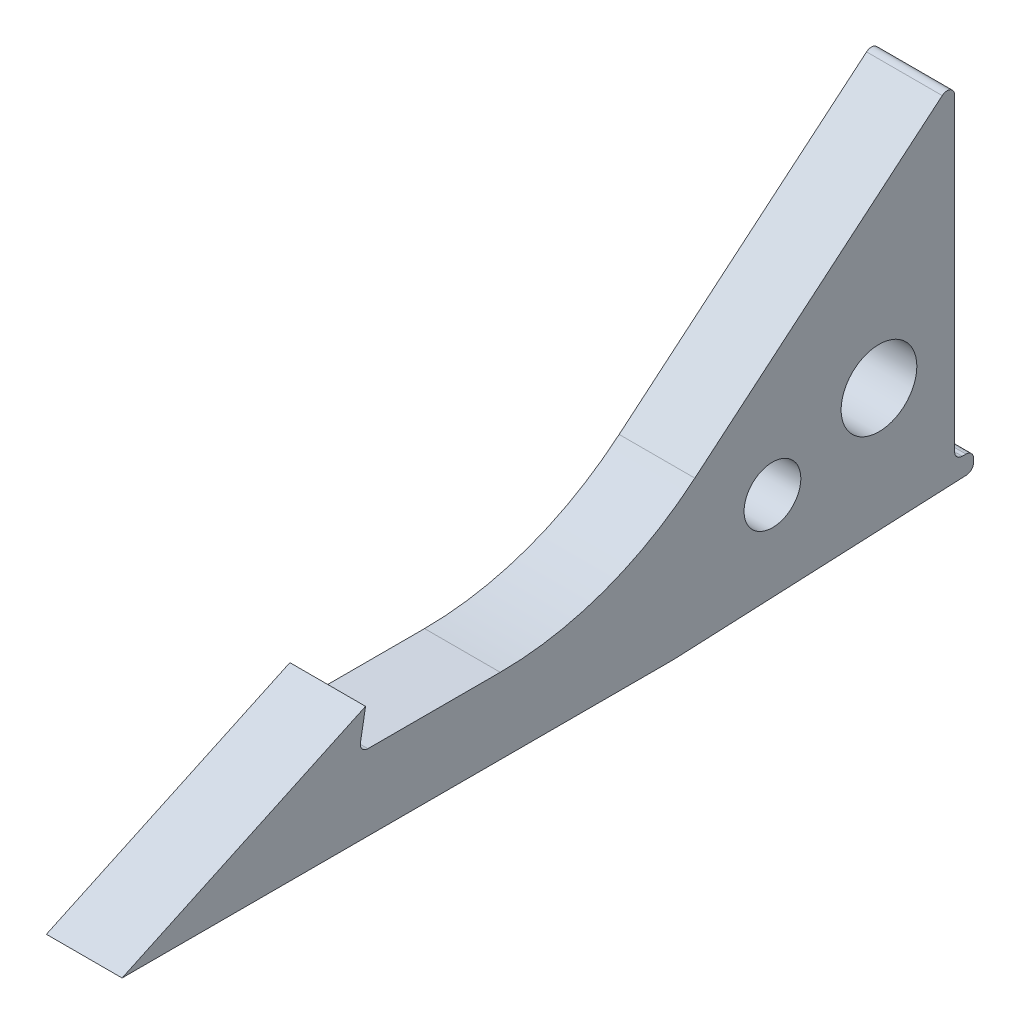
ISO-10303-21;
HEADER;
FILE_DESCRIPTION(('STEP AP214'),'2;1');
FILE_NAME('part.step','',(''),(''),'','','');
FILE_SCHEMA(('AUTOMOTIVE_DESIGN { 1 0 10303 214 1 1 1 1 }'));
ENDSEC;
DATA;
#1=APPLICATION_CONTEXT('core data for automotive mechanical design processes');
#2=APPLICATION_PROTOCOL_DEFINITION('international standard','automotive_design',2000,#1);
#3=PRODUCT_CONTEXT('',#1,'mechanical');
#4=PRODUCT('Part','Part','',(#3));
#5=PRODUCT_RELATED_PRODUCT_CATEGORY('part','',(#4));
#6=PRODUCT_DEFINITION_FORMATION('','',#4);
#7=PRODUCT_DEFINITION_CONTEXT('part definition',#1,'design');
#8=PRODUCT_DEFINITION('design','',#6,#7);
#9=PRODUCT_DEFINITION_SHAPE('','',#8);
#10=(LENGTH_UNIT() NAMED_UNIT(*) SI_UNIT(.MILLI.,.METRE.));
#11=(NAMED_UNIT(*) PLANE_ANGLE_UNIT() SI_UNIT($,.RADIAN.));
#12=(NAMED_UNIT(*) SI_UNIT($,.STERADIAN.) SOLID_ANGLE_UNIT());
#13=UNCERTAINTY_MEASURE_WITH_UNIT(LENGTH_MEASURE(1.E-05),#10,'distance_accuracy_value','');
#14=(GEOMETRIC_REPRESENTATION_CONTEXT(3) GLOBAL_UNCERTAINTY_ASSIGNED_CONTEXT((#13)) GLOBAL_UNIT_ASSIGNED_CONTEXT((#10,
#11,#12)) REPRESENTATION_CONTEXT('',''));
#15=CARTESIAN_POINT('',(0.,0.,0.));
#16=DIRECTION('',(0.,0.,1.));
#17=DIRECTION('',(1.,0.,0.));
#18=AXIS2_PLACEMENT_3D('',#15,#16,#17);
#19=CARTESIAN_POINT('',(15.875,0.,0.));
#20=DIRECTION('',(1.,0.,0.));
#21=DIRECTION('',(0.,0.,-1.));
#22=AXIS2_PLACEMENT_3D('',#19,#20,#21);
#23=PLANE('',#22);
#24=CARTESIAN_POINT('',(15.875,11.1125,46.27372));
#25=DIRECTION('',(1.,0.,0.));
#26=DIRECTION('',(0.,0.,-1.));
#27=AXIS2_PLACEMENT_3D('',#24,#25,#26);
#28=CIRCLE('',#27,3.175);
#29=CARTESIAN_POINT('',(15.875,11.1125,43.09872));
#30=VERTEX_POINT('',#29);
#31=EDGE_CURVE('E181',#30,#30,#28,.T.);
#32=ORIENTED_EDGE('',*,*,#31,.F.);
#33=EDGE_LOOP('',(#32));
#34=FACE_BOUND('',#33,.T.);
#35=DIRECTION('',(0.,0.,-1.));
#36=VECTOR('',#35,1.);
#37=CARTESIAN_POINT('',(15.875,0.,109.77372));
#38=LINE('',#37,#36);
#39=CARTESIAN_POINT('',(15.875,0.,109.77372));
#40=VERTEX_POINT('',#39);
#41=CARTESIAN_POINT('',(15.875,0.,64.0765676031377));
#42=VERTEX_POINT('',#41);
#43=EDGE_CURVE('E173',#40,#42,#38,.T.);
#44=ORIENTED_EDGE('',*,*,#43,.T.);
#45=CARTESIAN_POINT('',(15.875,25.4,64.0765676031377));
#46=DIRECTION('',(1.,0.,0.));
#47=DIRECTION('',(0.,0.,-1.));
#48=AXIS2_PLACEMENT_3D('',#45,#46,#47);
#49=CIRCLE('',#48,25.4);
#50=CARTESIAN_POINT('',(15.875,0.0261621258748286,62.9240262643513));
#51=VERTEX_POINT('',#50);
#52=EDGE_CURVE('E255',#42,#51,#49,.T.);
#53=ORIENTED_EDGE('',*,*,#52,.T.);
#54=DIRECTION('',(0.,0.0453756432593051,-0.998969995044298));
#55=VECTOR('',#54,1.);
#56=CARTESIAN_POINT('',(15.875,0.,63.5000000000002));
#57=LINE('',#56,#55);
#58=CARTESIAN_POINT('',(15.875,1.11546553851433,38.9424064665303));
#59=VERTEX_POINT('',#58);
#60=EDGE_CURVE('E200',#51,#59,#57,.T.);
#61=ORIENTED_EDGE('',*,*,#60,.T.);
#62=CARTESIAN_POINT('',(15.875,1.74981148536745,38.97122));
#63=DIRECTION('',(1.,0.,0.));
#64=DIRECTION('',(0.,0.,-1.));
#65=AXIS2_PLACEMENT_3D('',#62,#63,#64);
#66=CIRCLE('',#65,0.635);
#67=CARTESIAN_POINT('',(15.875,1.74981148536745,38.33622));
#68=VERTEX_POINT('',#67);
#69=EDGE_CURVE('E220',#59,#68,#66,.T.);
#70=ORIENTED_EDGE('',*,*,#69,.T.);
#71=DIRECTION('',(0.,1.,0.));
#72=VECTOR('',#71,1.);
#73=CARTESIAN_POINT('',(15.875,1.14300000000001,38.33622));
#74=LINE('',#73,#72);
#75=CARTESIAN_POINT('',(15.875,2.03200000000001,38.33622));
#76=VERTEX_POINT('',#75);
#77=EDGE_CURVE('E282',#68,#76,#74,.T.);
#78=ORIENTED_EDGE('',*,*,#77,.T.);
#79=CARTESIAN_POINT('',(15.875,2.03200000000001,38.97122));
#80=DIRECTION('',(1.,0.,0.));
#81=DIRECTION('',(0.,0.,-1.));
#82=AXIS2_PLACEMENT_3D('',#79,#80,#81);
#83=CIRCLE('',#82,0.635);
#84=CARTESIAN_POINT('',(15.875,2.66700000000001,38.97122));
#85=VERTEX_POINT('',#84);
#86=EDGE_CURVE('E218',#76,#85,#83,.T.);
#87=ORIENTED_EDGE('',*,*,#86,.T.);
#88=DIRECTION('',(0.,0.,1.));
#89=VECTOR('',#88,1.);
#90=CARTESIAN_POINT('',(15.875,2.66700000000001,38.33622));
#91=LINE('',#90,#89);
#92=CARTESIAN_POINT('',(15.875,2.66700000000001,39.28872));
#93=VERTEX_POINT('',#92);
#94=EDGE_CURVE('E279',#85,#93,#91,.T.);
#95=ORIENTED_EDGE('',*,*,#94,.T.);
#96=CARTESIAN_POINT('',(15.875,3.30200000000001,39.28872));
#97=DIRECTION('',(1.,0.,0.));
#98=DIRECTION('',(0.,0.,-1.));
#99=AXIS2_PLACEMENT_3D('',#96,#97,#98);
#100=CIRCLE('',#99,0.635);
#101=CARTESIAN_POINT('',(15.875,3.30200000000001,39.92372));
#102=VERTEX_POINT('',#101);
#103=EDGE_CURVE('E246',#93,#102,#100,.F.);
#104=ORIENTED_EDGE('',*,*,#103,.T.);
#105=DIRECTION('',(0.,1.,0.));
#106=VECTOR('',#105,1.);
#107=CARTESIAN_POINT('',(15.875,2.66700000000001,39.92372));
#108=LINE('',#107,#106);
#109=CARTESIAN_POINT('',(15.875,29.2220821357437,39.92372));
#110=VERTEX_POINT('',#109);
#111=EDGE_CURVE('E274',#102,#110,#108,.T.);
#112=ORIENTED_EDGE('',*,*,#111,.T.);
#113=CARTESIAN_POINT('',(15.875,29.2220821357437,40.55872));
#114=DIRECTION('',(1.,0.,0.));
#115=DIRECTION('',(0.,0.,-1.));
#116=AXIS2_PLACEMENT_3D('',#113,#114,#115);
#117=CIRCLE('',#116,0.635);
#118=CARTESIAN_POINT('',(15.875,29.7085203571243,40.9668901321509));
#119=VERTEX_POINT('',#118);
#120=EDGE_CURVE('E216',#110,#119,#117,.T.);
#121=ORIENTED_EDGE('',*,*,#120,.T.);
#122=DIRECTION('',(0.,-0.642787609686539,0.766044443118978));
#123=VECTOR('',#122,1.);
#124=CARTESIAN_POINT('',(15.875,30.5838440302673,39.92372));
#125=LINE('',#124,#123);
#126=CARTESIAN_POINT('',(15.875,12.2924711447779,61.7225293497622));
#127=VERTEX_POINT('',#126);
#128=EDGE_CURVE('E273',#119,#127,#125,.T.);
#129=ORIENTED_EDGE('',*,*,#128,.T.);
#130=CARTESIAN_POINT('',(15.875,31.75,78.0493346358003));
#131=DIRECTION('',(1.,0.,0.));
#132=DIRECTION('',(0.,0.,-1.));
#133=AXIS2_PLACEMENT_3D('',#130,#131,#132);
#134=CIRCLE('',#133,25.4);
#135=CARTESIAN_POINT('',(15.875,6.34999999999998,78.0493346358003));
#136=VERTEX_POINT('',#135);
#137=EDGE_CURVE('E11',#127,#136,#134,.F.);
#138=ORIENTED_EDGE('',*,*,#137,.T.);
#139=DIRECTION('',(0.,0.,1.));
#140=VECTOR('',#139,1.);
#141=CARTESIAN_POINT('',(15.875,6.34999999999998,68.8044906854388));
#142=LINE('',#141,#140);
#143=CARTESIAN_POINT('',(15.875,6.34999999999998,89.1503662145982));
#144=VERTEX_POINT('',#143);
#145=EDGE_CURVE('E158',#136,#144,#142,.T.);
#146=ORIENTED_EDGE('',*,*,#145,.T.);
#147=CARTESIAN_POINT('',(15.875,6.98499999999998,89.1503662145982));
#148=DIRECTION('',(1.,0.,0.));
#149=DIRECTION('',(0.,0.,-1.));
#150=AXIS2_PLACEMENT_3D('',#147,#148,#149);
#151=CIRCLE('',#150,0.635);
#152=CARTESIAN_POINT('',(15.875,7.09526659281849,89.7757191377609));
#153=VERTEX_POINT('',#152);
#154=EDGE_CURVE('E154',#144,#153,#151,.F.);
#155=ORIENTED_EDGE('',*,*,#154,.T.);
#156=DIRECTION('',(0.,0.984807753012207,-0.173648177666936));
#157=VECTOR('',#156,1.);
#158=CARTESIAN_POINT('',(15.875,6.34999999999998,89.9071297458955));
#159=LINE('',#158,#157);
#160=CARTESIAN_POINT('',(15.875,9.52499999999999,89.3472915821461));
#161=VERTEX_POINT('',#160);
#162=EDGE_CURVE('E146',#153,#161,#159,.T.);
#163=ORIENTED_EDGE('',*,*,#162,.T.);
#164=DIRECTION('',(0.,-0.422618261740694,0.906307787036653));
#165=VECTOR('',#164,1.);
#166=CARTESIAN_POINT('',(15.875,9.52499999999999,89.3472915821461));
#167=LINE('',#166,#165);
#168=EDGE_CURVE('E151',#161,#40,#167,.T.);
#169=ORIENTED_EDGE('',*,*,#168,.T.);
#170=EDGE_LOOP('',(#44,#53,#61,#70,#78,#87,#95,#104,#112,#121,#129,#138,#146,#155,#163,#169));
#171=FACE_BOUND('',#170,.T.);
#172=CARTESIAN_POINT('',(15.875,7.81806875397115,55.2108530842272));
#173=DIRECTION('',(1.,0.,0.));
#174=DIRECTION('',(0.,0.,-1.));
#175=AXIS2_PLACEMENT_3D('',#172,#173,#174);
#176=CIRCLE('',#175,2.38125);
#177=CARTESIAN_POINT('',(15.875,7.81806875397115,52.8296030842272));
#178=VERTEX_POINT('',#177);
#179=EDGE_CURVE('E289',#178,#178,#176,.T.);
#180=ORIENTED_EDGE('',*,*,#179,.F.);
#181=EDGE_LOOP('',(#180));
#182=FACE_BOUND('',#181,.T.);
#183=ADVANCED_FACE('F35',(#34,#171,#182),#23,.T.);
#184=CARTESIAN_POINT('',(9.52499999999998,0.,0.));
#185=DIRECTION('',(1.,0.,0.));
#186=DIRECTION('',(0.,0.,-1.));
#187=AXIS2_PLACEMENT_3D('',#184,#185,#186);
#188=PLANE('',#187);
#189=DIRECTION('',(0.,0.0453756432593051,-0.998969995044298));
#190=VECTOR('',#189,1.);
#191=CARTESIAN_POINT('',(9.52499999999998,0.,63.5000000000002));
#192=LINE('',#191,#190);
#193=CARTESIAN_POINT('',(9.52499999999998,0.0261621258748286,62.9240262643513));
#194=VERTEX_POINT('',#193);
#195=CARTESIAN_POINT('',(9.52499999999998,1.11546553851433,38.9424064665303));
#196=VERTEX_POINT('',#195);
#197=EDGE_CURVE('E178',#194,#196,#192,.T.);
#198=ORIENTED_EDGE('',*,*,#197,.F.);
#199=CARTESIAN_POINT('',(9.52499999999998,25.4,64.0765676031377));
#200=DIRECTION('',(1.,0.,0.));
#201=DIRECTION('',(0.,0.,-1.));
#202=AXIS2_PLACEMENT_3D('',#199,#200,#201);
#203=CIRCLE('',#202,25.4);
#204=CARTESIAN_POINT('',(9.52499999999999,0.,64.0765676031377));
#205=VERTEX_POINT('',#204);
#206=EDGE_CURVE('E251',#194,#205,#203,.F.);
#207=ORIENTED_EDGE('',*,*,#206,.T.);
#208=DIRECTION('',(0.,0.,-1.));
#209=VECTOR('',#208,1.);
#210=CARTESIAN_POINT('',(9.52499999999999,0.,109.77372));
#211=LINE('',#210,#209);
#212=CARTESIAN_POINT('',(9.52499999999999,0.,109.77372));
#213=VERTEX_POINT('',#212);
#214=EDGE_CURVE('E197',#213,#205,#211,.T.);
#215=ORIENTED_EDGE('',*,*,#214,.F.);
#216=DIRECTION('',(0.,-0.422618261740694,0.906307787036653));
#217=VECTOR('',#216,1.);
#218=CARTESIAN_POINT('',(9.52499999999999,9.52499999999999,89.3472915821461));
#219=LINE('',#218,#217);
#220=CARTESIAN_POINT('',(9.52499999999999,9.52499999999999,89.3472915821461));
#221=VERTEX_POINT('',#220);
#222=EDGE_CURVE('E195',#221,#213,#219,.T.);
#223=ORIENTED_EDGE('',*,*,#222,.F.);
#224=DIRECTION('',(0.,0.984807753012207,-0.173648177666936));
#225=VECTOR('',#224,1.);
#226=CARTESIAN_POINT('',(9.52499999999999,6.34999999999998,89.9071297458955));
#227=LINE('',#226,#225);
#228=CARTESIAN_POINT('',(9.52499999999999,7.09526659281849,89.7757191377609));
#229=VERTEX_POINT('',#228);
#230=EDGE_CURVE('E164',#229,#221,#227,.T.);
#231=ORIENTED_EDGE('',*,*,#230,.F.);
#232=CARTESIAN_POINT('',(9.52499999999998,6.98499999999998,89.1503662145982));
#233=DIRECTION('',(1.,0.,0.));
#234=DIRECTION('',(0.,0.,-1.));
#235=AXIS2_PLACEMENT_3D('',#232,#233,#234);
#236=CIRCLE('',#235,0.635);
#237=CARTESIAN_POINT('',(9.52499999999999,6.34999999999998,89.1503662145982));
#238=VERTEX_POINT('',#237);
#239=EDGE_CURVE('E240',#229,#238,#236,.T.);
#240=ORIENTED_EDGE('',*,*,#239,.T.);
#241=DIRECTION('',(0.,0.,1.));
#242=VECTOR('',#241,1.);
#243=CARTESIAN_POINT('',(9.52499999999999,6.34999999999998,68.8044906854388));
#244=LINE('',#243,#242);
#245=CARTESIAN_POINT('',(9.52499999999999,6.34999999999998,78.0493346358003));
#246=VERTEX_POINT('',#245);
#247=EDGE_CURVE('E192',#246,#238,#244,.T.);
#248=ORIENTED_EDGE('',*,*,#247,.F.);
#249=CARTESIAN_POINT('',(9.52499999999998,31.75,78.0493346358003));
#250=DIRECTION('',(1.,0.,0.));
#251=DIRECTION('',(0.,0.,-1.));
#252=AXIS2_PLACEMENT_3D('',#249,#250,#251);
#253=CIRCLE('',#252,25.4);
#254=CARTESIAN_POINT('',(9.52499999999999,12.2924711447779,61.7225293497622));
#255=VERTEX_POINT('',#254);
#256=EDGE_CURVE('E43',#246,#255,#253,.T.);
#257=ORIENTED_EDGE('',*,*,#256,.T.);
#258=DIRECTION('',(0.,-0.642787609686539,0.766044443118978));
#259=VECTOR('',#258,1.);
#260=CARTESIAN_POINT('',(9.52499999999998,30.5838440302673,39.92372));
#261=LINE('',#260,#259);
#262=CARTESIAN_POINT('',(9.52499999999998,29.7085203571243,40.9668901321509));
#263=VERTEX_POINT('',#262);
#264=EDGE_CURVE('E190',#263,#255,#261,.T.);
#265=ORIENTED_EDGE('',*,*,#264,.F.);
#266=CARTESIAN_POINT('',(9.52499999999998,29.2220821357437,40.55872));
#267=DIRECTION('',(1.,0.,0.));
#268=DIRECTION('',(0.,0.,-1.));
#269=AXIS2_PLACEMENT_3D('',#266,#267,#268);
#270=CIRCLE('',#269,0.635);
#271=CARTESIAN_POINT('',(9.52499999999998,29.2220821357437,39.92372));
#272=VERTEX_POINT('',#271);
#273=EDGE_CURVE('E206',#263,#272,#270,.F.);
#274=ORIENTED_EDGE('',*,*,#273,.T.);
#275=DIRECTION('',(0.,1.,0.));
#276=VECTOR('',#275,1.);
#277=CARTESIAN_POINT('',(9.52499999999998,3.17500000000001,39.92372));
#278=LINE('',#277,#276);
#279=CARTESIAN_POINT('',(9.52499999999998,3.30200000000001,39.92372));
#280=VERTEX_POINT('',#279);
#281=EDGE_CURVE('E187',#280,#272,#278,.T.);
#282=ORIENTED_EDGE('',*,*,#281,.F.);
#283=CARTESIAN_POINT('',(9.52499999999998,3.30200000000001,39.28872));
#284=DIRECTION('',(1.,0.,0.));
#285=DIRECTION('',(0.,0.,-1.));
#286=AXIS2_PLACEMENT_3D('',#283,#284,#285);
#287=CIRCLE('',#286,0.635);
#288=CARTESIAN_POINT('',(9.52499999999998,2.66700000000001,39.28872));
#289=VERTEX_POINT('',#288);
#290=EDGE_CURVE('E244',#280,#289,#287,.T.);
#291=ORIENTED_EDGE('',*,*,#290,.T.);
#292=DIRECTION('',(0.,0.,1.));
#293=VECTOR('',#292,1.);
#294=CARTESIAN_POINT('',(9.52499999999998,2.66700000000001,38.33622));
#295=LINE('',#294,#293);
#296=CARTESIAN_POINT('',(9.52499999999998,2.66700000000001,38.97122));
#297=VERTEX_POINT('',#296);
#298=EDGE_CURVE('E184',#297,#289,#295,.T.);
#299=ORIENTED_EDGE('',*,*,#298,.F.);
#300=CARTESIAN_POINT('',(9.52499999999998,2.03200000000001,38.97122));
#301=DIRECTION('',(1.,0.,0.));
#302=DIRECTION('',(0.,0.,-1.));
#303=AXIS2_PLACEMENT_3D('',#300,#301,#302);
#304=CIRCLE('',#303,0.635);
#305=CARTESIAN_POINT('',(9.52499999999998,2.03200000000001,38.33622));
#306=VERTEX_POINT('',#305);
#307=EDGE_CURVE('E208',#297,#306,#304,.F.);
#308=ORIENTED_EDGE('',*,*,#307,.T.);
#309=DIRECTION('',(0.,1.,0.));
#310=VECTOR('',#309,1.);
#311=CARTESIAN_POINT('',(9.52499999999998,1.14300000000001,38.33622));
#312=LINE('',#311,#310);
#313=CARTESIAN_POINT('',(9.52499999999998,1.74981148536745,38.33622));
#314=VERTEX_POINT('',#313);
#315=EDGE_CURVE('E180',#314,#306,#312,.T.);
#316=ORIENTED_EDGE('',*,*,#315,.F.);
#317=CARTESIAN_POINT('',(9.52499999999998,1.74981148536745,38.97122));
#318=DIRECTION('',(1.,0.,0.));
#319=DIRECTION('',(0.,0.,-1.));
#320=AXIS2_PLACEMENT_3D('',#317,#318,#319);
#321=CIRCLE('',#320,0.635);
#322=EDGE_CURVE('E210',#314,#196,#321,.F.);
#323=ORIENTED_EDGE('',*,*,#322,.T.);
#324=EDGE_LOOP('',(#198,#207,#215,#223,#231,#240,#248,#257,#265,#274,#282,#291,#299,#308,#316,#323));
#325=FACE_BOUND('',#324,.T.);
#326=CARTESIAN_POINT('',(9.52499999999998,11.1125,46.27372));
#327=DIRECTION('',(1.,0.,0.));
#328=DIRECTION('',(0.,0.,-1.));
#329=AXIS2_PLACEMENT_3D('',#326,#327,#328);
#330=CIRCLE('',#329,3.175);
#331=CARTESIAN_POINT('',(9.52499999999998,11.1125,43.09872));
#332=VERTEX_POINT('',#331);
#333=EDGE_CURVE('E286',#332,#332,#330,.T.);
#334=ORIENTED_EDGE('',*,*,#333,.T.);
#335=EDGE_LOOP('',(#334));
#336=FACE_BOUND('',#335,.T.);
#337=CARTESIAN_POINT('',(9.52499999999998,7.81806875397115,55.2108530842272));
#338=DIRECTION('',(1.,0.,0.));
#339=DIRECTION('',(0.,0.,-1.));
#340=AXIS2_PLACEMENT_3D('',#337,#338,#339);
#341=CIRCLE('',#340,2.38125);
#342=CARTESIAN_POINT('',(9.52499999999998,7.81806875397115,52.8296030842272));
#343=VERTEX_POINT('',#342);
#344=EDGE_CURVE('E292',#343,#343,#341,.T.);
#345=ORIENTED_EDGE('',*,*,#344,.T.);
#346=EDGE_LOOP('',(#345));
#347=FACE_BOUND('',#346,.T.);
#348=ADVANCED_FACE('F264',(#325,#336,#347),#188,.F.);
#349=CARTESIAN_POINT('',(15.875,0.,63.5000000000002));
#350=DIRECTION('',(0.,0.998969995044298,0.0453756432593051));
#351=DIRECTION('',(0.,-0.0453756432593051,0.998969995044298));
#352=AXIS2_PLACEMENT_3D('',#349,#350,#351);
#353=PLANE('',#352);
#354=ORIENTED_EDGE('',*,*,#60,.F.);
#355=DIRECTION('',(-1.,0.,0.));
#356=VECTOR('',#355,1.);
#357=CARTESIAN_POINT('',(15.875,0.0261621258748286,62.9240262643513));
#358=LINE('',#357,#356);
#359=EDGE_CURVE('E248',#51,#194,#358,.T.);
#360=ORIENTED_EDGE('',*,*,#359,.T.);
#361=ORIENTED_EDGE('',*,*,#197,.T.);
#362=DIRECTION('',(-1.,0.,0.));
#363=VECTOR('',#362,1.);
#364=CARTESIAN_POINT('',(15.875,1.11546553851433,38.9424064665303));
#365=LINE('',#364,#363);
#366=EDGE_CURVE('E213',#196,#59,#365,.F.);
#367=ORIENTED_EDGE('',*,*,#366,.T.);
#368=EDGE_LOOP('',(#354,#360,#361,#367));
#369=FACE_BOUND('',#368,.T.);
#370=ADVANCED_FACE('F306',(#369),#353,.F.);
#371=CARTESIAN_POINT('',(15.875,1.14300000000001,38.33622));
#372=DIRECTION('',(0.,0.,1.));
#373=DIRECTION('',(1.,0.,0.));
#374=AXIS2_PLACEMENT_3D('',#371,#372,#373);
#375=PLANE('',#374);
#376=ORIENTED_EDGE('',*,*,#77,.F.);
#377=DIRECTION('',(-1.,0.,0.));
#378=VECTOR('',#377,1.);
#379=CARTESIAN_POINT('',(15.875,1.74981148536745,38.33622));
#380=LINE('',#379,#378);
#381=EDGE_CURVE('E203',#68,#314,#380,.T.);
#382=ORIENTED_EDGE('',*,*,#381,.T.);
#383=ORIENTED_EDGE('',*,*,#315,.T.);
#384=DIRECTION('',(-1.,0.,0.));
#385=VECTOR('',#384,1.);
#386=CARTESIAN_POINT('',(15.875,2.03200000000001,38.33622));
#387=LINE('',#386,#385);
#388=EDGE_CURVE('E167',#306,#76,#387,.F.);
#389=ORIENTED_EDGE('',*,*,#388,.T.);
#390=EDGE_LOOP('',(#376,#382,#383,#389));
#391=FACE_BOUND('',#390,.T.);
#392=ADVANCED_FACE('F332',(#391),#375,.F.);
#393=CARTESIAN_POINT('',(15.875,2.66700000000001,38.33622));
#394=DIRECTION('',(0.,-1.,0.));
#395=DIRECTION('',(0.,0.,-1.));
#396=AXIS2_PLACEMENT_3D('',#393,#394,#395);
#397=PLANE('',#396);
#398=ORIENTED_EDGE('',*,*,#94,.F.);
#399=DIRECTION('',(-1.,0.,0.));
#400=VECTOR('',#399,1.);
#401=CARTESIAN_POINT('',(15.875,2.66700000000001,38.97122));
#402=LINE('',#401,#400);
#403=EDGE_CURVE('E224',#85,#297,#402,.T.);
#404=ORIENTED_EDGE('',*,*,#403,.T.);
#405=ORIENTED_EDGE('',*,*,#298,.T.);
#406=DIRECTION('',(-1.,0.,0.));
#407=VECTOR('',#406,1.);
#408=CARTESIAN_POINT('',(15.875,2.66700000000001,39.28872));
#409=LINE('',#408,#407);
#410=EDGE_CURVE('E222',#289,#93,#409,.F.);
#411=ORIENTED_EDGE('',*,*,#410,.T.);
#412=EDGE_LOOP('',(#398,#404,#405,#411));
#413=FACE_BOUND('',#412,.T.);
#414=ADVANCED_FACE('F328',(#413),#397,.F.);
#415=CARTESIAN_POINT('',(15.875,3.17500000000001,39.92372));
#416=DIRECTION('',(0.,0.,1.));
#417=DIRECTION('',(1.,0.,0.));
#418=AXIS2_PLACEMENT_3D('',#415,#416,#417);
#419=PLANE('',#418);
#420=ORIENTED_EDGE('',*,*,#281,.T.);
#421=DIRECTION('',(-1.,0.,0.));
#422=VECTOR('',#421,1.);
#423=CARTESIAN_POINT('',(15.875,29.2220821357437,39.92372));
#424=LINE('',#423,#422);
#425=EDGE_CURVE('E233',#272,#110,#424,.F.);
#426=ORIENTED_EDGE('',*,*,#425,.T.);
#427=ORIENTED_EDGE('',*,*,#111,.F.);
#428=DIRECTION('',(-1.,0.,0.));
#429=VECTOR('',#428,1.);
#430=CARTESIAN_POINT('',(9.52499999999998,3.30200000000001,39.92372));
#431=LINE('',#430,#429);
#432=EDGE_CURVE('E230',#102,#280,#431,.T.);
#433=ORIENTED_EDGE('',*,*,#432,.T.);
#434=EDGE_LOOP('',(#420,#426,#427,#433));
#435=FACE_BOUND('',#434,.T.);
#436=ADVANCED_FACE('F325',(#435),#419,.F.);
#437=CARTESIAN_POINT('',(15.875,30.5838440302673,39.92372));
#438=DIRECTION('',(0.,-0.766044443118978,-0.642787609686539));
#439=DIRECTION('',(0.,0.642787609686539,-0.766044443118978));
#440=AXIS2_PLACEMENT_3D('',#437,#438,#439);
#441=PLANE('',#440);
#442=ORIENTED_EDGE('',*,*,#264,.T.);
#443=DIRECTION('',(-1.,0.,0.));
#444=VECTOR('',#443,1.);
#445=CARTESIAN_POINT('',(15.875,12.292471144778,61.7225293497622));
#446=LINE('',#445,#444);
#447=EDGE_CURVE('E56',#255,#127,#446,.F.);
#448=ORIENTED_EDGE('',*,*,#447,.T.);
#449=ORIENTED_EDGE('',*,*,#128,.F.);
#450=DIRECTION('',(-1.,0.,0.));
#451=VECTOR('',#450,1.);
#452=CARTESIAN_POINT('',(15.875,29.7085203571243,40.9668901321509));
#453=LINE('',#452,#451);
#454=EDGE_CURVE('E227',#119,#263,#453,.T.);
#455=ORIENTED_EDGE('',*,*,#454,.T.);
#456=EDGE_LOOP('',(#442,#448,#449,#455));
#457=FACE_BOUND('',#456,.T.);
#458=ADVANCED_FACE('F268',(#457),#441,.F.);
#459=CARTESIAN_POINT('',(15.875,6.34999999999998,68.8044906854388));
#460=DIRECTION('',(0.,-1.,0.));
#461=DIRECTION('',(0.,0.,-1.));
#462=AXIS2_PLACEMENT_3D('',#459,#460,#461);
#463=PLANE('',#462);
#464=ORIENTED_EDGE('',*,*,#145,.F.);
#465=DIRECTION('',(-1.,0.,0.));
#466=VECTOR('',#465,1.);
#467=CARTESIAN_POINT('',(9.52499999999999,6.34999999999998,78.0493346358003));
#468=LINE('',#467,#466);
#469=EDGE_CURVE('E257',#136,#246,#468,.T.);
#470=ORIENTED_EDGE('',*,*,#469,.T.);
#471=ORIENTED_EDGE('',*,*,#247,.T.);
#472=DIRECTION('',(-1.,0.,0.));
#473=VECTOR('',#472,1.);
#474=CARTESIAN_POINT('',(15.875,6.34999999999998,89.1503662145982));
#475=LINE('',#474,#473);
#476=EDGE_CURVE('E237',#238,#144,#475,.F.);
#477=ORIENTED_EDGE('',*,*,#476,.T.);
#478=EDGE_LOOP('',(#464,#470,#471,#477));
#479=FACE_BOUND('',#478,.T.);
#480=ADVANCED_FACE('F271',(#479),#463,.F.);
#481=CARTESIAN_POINT('',(15.875,6.34999999999998,89.9071297458955));
#482=DIRECTION('',(0.,0.173648177666936,0.984807753012207));
#483=DIRECTION('',(0.,-0.984807753012207,0.173648177666936));
#484=AXIS2_PLACEMENT_3D('',#481,#482,#483);
#485=PLANE('',#484);
#486=ORIENTED_EDGE('',*,*,#162,.F.);
#487=DIRECTION('',(-1.,0.,0.));
#488=VECTOR('',#487,1.);
#489=CARTESIAN_POINT('',(9.52499999999999,7.09526659281849,89.7757191377609));
#490=LINE('',#489,#488);
#491=EDGE_CURVE('E235',#153,#229,#490,.T.);
#492=ORIENTED_EDGE('',*,*,#491,.T.);
#493=ORIENTED_EDGE('',*,*,#230,.T.);
#494=DIRECTION('',(-1.,0.,0.));
#495=VECTOR('',#494,1.);
#496=CARTESIAN_POINT('',(15.875,9.52499999999999,89.3472915821461));
#497=LINE('',#496,#495);
#498=EDGE_CURVE('E161',#161,#221,#497,.T.);
#499=ORIENTED_EDGE('',*,*,#498,.F.);
#500=EDGE_LOOP('',(#486,#492,#493,#499));
#501=FACE_BOUND('',#500,.T.);
#502=ADVANCED_FACE('F162',(#501),#485,.F.);
#503=CARTESIAN_POINT('',(15.875,9.52499999999999,89.3472915821461));
#504=DIRECTION('',(0.,-0.906307787036653,-0.422618261740694));
#505=DIRECTION('',(0.,0.422618261740694,-0.906307787036653));
#506=AXIS2_PLACEMENT_3D('',#503,#504,#505);
#507=PLANE('',#506);
#508=ORIENTED_EDGE('',*,*,#222,.T.);
#509=DIRECTION('',(-1.,0.,0.));
#510=VECTOR('',#509,1.);
#511=CARTESIAN_POINT('',(15.875,0.,109.77372));
#512=LINE('',#511,#510);
#513=EDGE_CURVE('E168',#40,#213,#512,.T.);
#514=ORIENTED_EDGE('',*,*,#513,.F.);
#515=ORIENTED_EDGE('',*,*,#168,.F.);
#516=ORIENTED_EDGE('',*,*,#498,.T.);
#517=EDGE_LOOP('',(#508,#514,#515,#516));
#518=FACE_BOUND('',#517,.T.);
#519=ADVANCED_FACE('F170',(#518),#507,.F.);
#520=CARTESIAN_POINT('',(15.875,0.,109.77372));
#521=DIRECTION('',(0.,1.,0.));
#522=DIRECTION('',(0.,0.,1.));
#523=AXIS2_PLACEMENT_3D('',#520,#521,#522);
#524=PLANE('',#523);
#525=ORIENTED_EDGE('',*,*,#214,.T.);
#526=DIRECTION('',(-1.,0.,0.));
#527=VECTOR('',#526,1.);
#528=CARTESIAN_POINT('',(15.875,0.,64.0765676031377));
#529=LINE('',#528,#527);
#530=EDGE_CURVE('E253',#205,#42,#529,.F.);
#531=ORIENTED_EDGE('',*,*,#530,.T.);
#532=ORIENTED_EDGE('',*,*,#43,.F.);
#533=ORIENTED_EDGE('',*,*,#513,.T.);
#534=EDGE_LOOP('',(#525,#531,#532,#533));
#535=FACE_BOUND('',#534,.T.);
#536=ADVANCED_FACE('F313',(#535),#524,.F.);
#537=CARTESIAN_POINT('',(15.875,11.1125,46.27372));
#538=DIRECTION('',(-1.,0.,0.));
#539=DIRECTION('',(0.,0.,1.));
#540=AXIS2_PLACEMENT_3D('',#537,#538,#539);
#541=CYLINDRICAL_SURFACE('',#540,3.175);
#542=ORIENTED_EDGE('',*,*,#31,.T.);
#543=EDGE_LOOP('',(#542));
#544=FACE_BOUND('',#543,.T.);
#545=ORIENTED_EDGE('',*,*,#333,.F.);
#546=EDGE_LOOP('',(#545));
#547=FACE_BOUND('',#546,.T.);
#548=ADVANCED_FACE('F310',(#544,#547),#541,.F.);
#549=CARTESIAN_POINT('',(15.875,7.81806875397115,55.2108530842272));
#550=DIRECTION('',(-1.,0.,0.));
#551=DIRECTION('',(0.,0.,1.));
#552=AXIS2_PLACEMENT_3D('',#549,#550,#551);
#553=CYLINDRICAL_SURFACE('',#552,2.38125);
#554=ORIENTED_EDGE('',*,*,#179,.T.);
#555=EDGE_LOOP('',(#554));
#556=FACE_BOUND('',#555,.T.);
#557=ORIENTED_EDGE('',*,*,#344,.F.);
#558=EDGE_LOOP('',(#557));
#559=FACE_BOUND('',#558,.T.);
#560=ADVANCED_FACE('F298',(#556,#559),#553,.F.);
#561=CARTESIAN_POINT('',(15.875,1.74981148536745,38.97122));
#562=DIRECTION('',(-1.,0.,0.));
#563=DIRECTION('',(0.,0.,1.));
#564=AXIS2_PLACEMENT_3D('',#561,#562,#563);
#565=CYLINDRICAL_SURFACE('',#564,0.635);
#566=ORIENTED_EDGE('',*,*,#69,.F.);
#567=ORIENTED_EDGE('',*,*,#366,.F.);
#568=ORIENTED_EDGE('',*,*,#322,.F.);
#569=ORIENTED_EDGE('',*,*,#381,.F.);
#570=EDGE_LOOP('',(#566,#567,#568,#569));
#571=FACE_BOUND('',#570,.T.);
#572=ADVANCED_FACE('F340',(#571),#565,.T.);
#573=CARTESIAN_POINT('',(15.875,2.03200000000001,38.97122));
#574=DIRECTION('',(-1.,0.,0.));
#575=DIRECTION('',(0.,0.,1.));
#576=AXIS2_PLACEMENT_3D('',#573,#574,#575);
#577=CYLINDRICAL_SURFACE('',#576,0.635);
#578=ORIENTED_EDGE('',*,*,#86,.F.);
#579=ORIENTED_EDGE('',*,*,#388,.F.);
#580=ORIENTED_EDGE('',*,*,#307,.F.);
#581=ORIENTED_EDGE('',*,*,#403,.F.);
#582=EDGE_LOOP('',(#578,#579,#580,#581));
#583=FACE_BOUND('',#582,.T.);
#584=ADVANCED_FACE('F343',(#583),#577,.T.);
#585=CARTESIAN_POINT('',(15.875,29.2220821357437,40.55872));
#586=DIRECTION('',(-1.,0.,0.));
#587=DIRECTION('',(0.,0.,1.));
#588=AXIS2_PLACEMENT_3D('',#585,#586,#587);
#589=CYLINDRICAL_SURFACE('',#588,0.635);
#590=ORIENTED_EDGE('',*,*,#120,.F.);
#591=ORIENTED_EDGE('',*,*,#425,.F.);
#592=ORIENTED_EDGE('',*,*,#273,.F.);
#593=ORIENTED_EDGE('',*,*,#454,.F.);
#594=EDGE_LOOP('',(#590,#591,#592,#593));
#595=FACE_BOUND('',#594,.T.);
#596=ADVANCED_FACE('F347',(#595),#589,.T.);
#597=CARTESIAN_POINT('',(15.875,6.98499999999998,89.1503662145982));
#598=DIRECTION('',(1.,0.,0.));
#599=DIRECTION('',(0.,0.,-1.));
#600=AXIS2_PLACEMENT_3D('',#597,#598,#599);
#601=CYLINDRICAL_SURFACE('',#600,0.635);
#602=ORIENTED_EDGE('',*,*,#154,.F.);
#603=ORIENTED_EDGE('',*,*,#476,.F.);
#604=ORIENTED_EDGE('',*,*,#239,.F.);
#605=ORIENTED_EDGE('',*,*,#491,.F.);
#606=EDGE_LOOP('',(#602,#603,#604,#605));
#607=FACE_BOUND('',#606,.T.);
#608=ADVANCED_FACE('F351',(#607),#601,.F.);
#609=CARTESIAN_POINT('',(15.875,3.30200000000001,39.28872));
#610=DIRECTION('',(1.,0.,0.));
#611=DIRECTION('',(0.,0.,-1.));
#612=AXIS2_PLACEMENT_3D('',#609,#610,#611);
#613=CYLINDRICAL_SURFACE('',#612,0.635);
#614=ORIENTED_EDGE('',*,*,#103,.F.);
#615=ORIENTED_EDGE('',*,*,#410,.F.);
#616=ORIENTED_EDGE('',*,*,#290,.F.);
#617=ORIENTED_EDGE('',*,*,#432,.F.);
#618=EDGE_LOOP('',(#614,#615,#616,#617));
#619=FACE_BOUND('',#618,.T.);
#620=ADVANCED_FACE('F355',(#619),#613,.F.);
#621=CARTESIAN_POINT('',(15.875,25.4,64.0765676031377));
#622=DIRECTION('',(-1.,0.,0.));
#623=DIRECTION('',(0.,0.,1.));
#624=AXIS2_PLACEMENT_3D('',#621,#622,#623);
#625=CYLINDRICAL_SURFACE('',#624,25.4);
#626=ORIENTED_EDGE('',*,*,#52,.F.);
#627=ORIENTED_EDGE('',*,*,#530,.F.);
#628=ORIENTED_EDGE('',*,*,#206,.F.);
#629=ORIENTED_EDGE('',*,*,#359,.F.);
#630=EDGE_LOOP('',(#626,#627,#628,#629));
#631=FACE_BOUND('',#630,.T.);
#632=ADVANCED_FACE('F358',(#631),#625,.T.);
#633=CARTESIAN_POINT('',(15.875,31.75,78.0493346358003));
#634=DIRECTION('',(1.,0.,0.));
#635=DIRECTION('',(0.,0.,-1.));
#636=AXIS2_PLACEMENT_3D('',#633,#634,#635);
#637=CYLINDRICAL_SURFACE('',#636,25.4);
#638=ORIENTED_EDGE('',*,*,#137,.F.);
#639=ORIENTED_EDGE('',*,*,#447,.F.);
#640=ORIENTED_EDGE('',*,*,#256,.F.);
#641=ORIENTED_EDGE('',*,*,#469,.F.);
#642=EDGE_LOOP('',(#638,#639,#640,#641));
#643=FACE_BOUND('',#642,.T.);
#644=ADVANCED_FACE('F37',(#643),#637,.F.);
#645=CLOSED_SHELL('',(#183,#348,#370,#392,#414,#436,#458,#480,#502,#519,#536,#548,#560,#572,
#584,#596,#608,#620,#632,#644));
#646=MANIFOLD_SOLID_BREP('B2',#645);
#647=ADVANCED_BREP_SHAPE_REPRESENTATION('',(#18,#646),#14);
#648=SHAPE_DEFINITION_REPRESENTATION(#9,#647);
ENDSEC;
END-ISO-10303-21;
